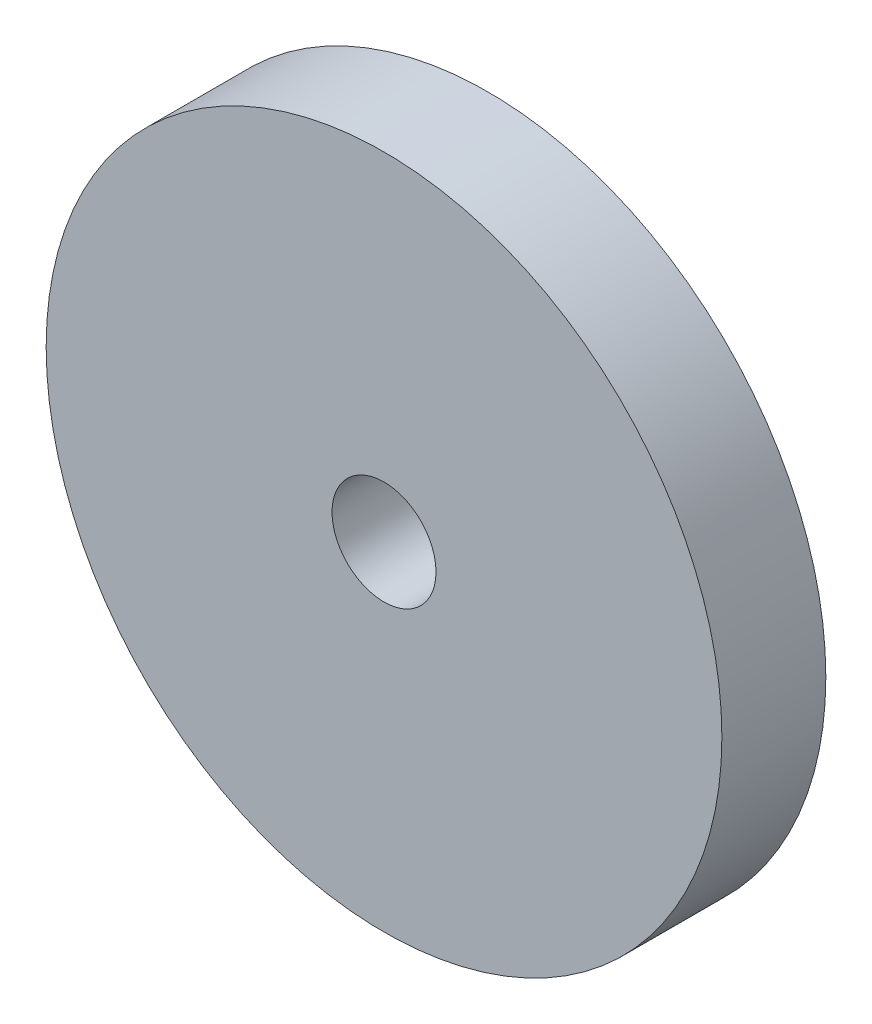
ISO-10303-21;
HEADER;
FILE_DESCRIPTION(('STEP AP214'),'2;1');
FILE_NAME('part.step','',(''),(''),'','','');
FILE_SCHEMA(('AUTOMOTIVE_DESIGN { 1 0 10303 214 1 1 1 1 }'));
ENDSEC;
DATA;
#1=APPLICATION_CONTEXT('core data for automotive mechanical design processes');
#2=APPLICATION_PROTOCOL_DEFINITION('international standard','automotive_design',2000,#1);
#3=PRODUCT_CONTEXT('',#1,'mechanical');
#4=PRODUCT('Part','Part','',(#3));
#5=PRODUCT_RELATED_PRODUCT_CATEGORY('part','',(#4));
#6=PRODUCT_DEFINITION_FORMATION('','',#4);
#7=PRODUCT_DEFINITION_CONTEXT('part definition',#1,'design');
#8=PRODUCT_DEFINITION('design','',#6,#7);
#9=PRODUCT_DEFINITION_SHAPE('','',#8);
#10=(LENGTH_UNIT() NAMED_UNIT(*) SI_UNIT(.MILLI.,.METRE.));
#11=(NAMED_UNIT(*) PLANE_ANGLE_UNIT() SI_UNIT($,.RADIAN.));
#12=(NAMED_UNIT(*) SI_UNIT($,.STERADIAN.) SOLID_ANGLE_UNIT());
#13=UNCERTAINTY_MEASURE_WITH_UNIT(LENGTH_MEASURE(1.E-05),#10,'distance_accuracy_value','');
#14=(GEOMETRIC_REPRESENTATION_CONTEXT(3) GLOBAL_UNCERTAINTY_ASSIGNED_CONTEXT((#13)) GLOBAL_UNIT_ASSIGNED_CONTEXT((#10,
#11,#12)) REPRESENTATION_CONTEXT('',''));
#15=CARTESIAN_POINT('',(0.,0.,0.));
#16=DIRECTION('',(0.,0.,1.));
#17=DIRECTION('',(1.,0.,0.));
#18=AXIS2_PLACEMENT_3D('',#15,#16,#17);
#19=CARTESIAN_POINT('',(0.,0.,6.35));
#20=DIRECTION('',(0.,0.,1.));
#21=DIRECTION('',(1.,0.,0.));
#22=AXIS2_PLACEMENT_3D('',#19,#20,#21);
#23=PLANE('',#22);
#24=CARTESIAN_POINT('',(0.,0.,6.35));
#25=DIRECTION('',(0.,0.,1.));
#26=DIRECTION('',(1.,0.,0.));
#27=AXIS2_PLACEMENT_3D('',#24,#25,#26);
#28=CIRCLE('',#27,41.275);
#29=CARTESIAN_POINT('',(41.275,0.,6.35));
#30=VERTEX_POINT('',#29);
#31=EDGE_CURVE('E10',#30,#30,#28,.T.);
#32=ORIENTED_EDGE('',*,*,#31,.T.);
#33=EDGE_LOOP('',(#32));
#34=FACE_BOUND('',#33,.T.);
#35=CARTESIAN_POINT('',(0.,0.,6.35));
#36=DIRECTION('',(0.,0.,1.));
#37=DIRECTION('',(1.,0.,0.));
#38=AXIS2_PLACEMENT_3D('',#35,#36,#37);
#39=CIRCLE('',#38,6.35);
#40=CARTESIAN_POINT('',(6.35,0.,6.35));
#41=VERTEX_POINT('',#40);
#42=EDGE_CURVE('E42',#41,#41,#39,.T.);
#43=ORIENTED_EDGE('',*,*,#42,.F.);
#44=EDGE_LOOP('',(#43));
#45=FACE_BOUND('',#44,.T.);
#46=ADVANCED_FACE('F31',(#34,#45),#23,.T.);
#47=CARTESIAN_POINT('',(0.,0.,-6.35));
#48=DIRECTION('',(0.,0.,1.));
#49=DIRECTION('',(1.,0.,0.));
#50=AXIS2_PLACEMENT_3D('',#47,#48,#49);
#51=PLANE('',#50);
#52=CARTESIAN_POINT('',(0.,0.,-6.35));
#53=DIRECTION('',(0.,0.,1.));
#54=DIRECTION('',(1.,0.,0.));
#55=AXIS2_PLACEMENT_3D('',#52,#53,#54);
#56=CIRCLE('',#55,41.275);
#57=CARTESIAN_POINT('',(41.275,0.,-6.35));
#58=VERTEX_POINT('',#57);
#59=EDGE_CURVE('E35',#58,#58,#56,.T.);
#60=ORIENTED_EDGE('',*,*,#59,.F.);
#61=EDGE_LOOP('',(#60));
#62=FACE_BOUND('',#61,.T.);
#63=CARTESIAN_POINT('',(0.,0.,-6.35));
#64=DIRECTION('',(0.,0.,1.));
#65=DIRECTION('',(1.,0.,0.));
#66=AXIS2_PLACEMENT_3D('',#63,#64,#65);
#67=CIRCLE('',#66,6.35);
#68=CARTESIAN_POINT('',(6.35,0.,-6.35));
#69=VERTEX_POINT('',#68);
#70=EDGE_CURVE('E44',#69,#69,#67,.T.);
#71=ORIENTED_EDGE('',*,*,#70,.T.);
#72=EDGE_LOOP('',(#71));
#73=FACE_BOUND('',#72,.T.);
#74=ADVANCED_FACE('F54',(#62,#73),#51,.F.);
#75=CARTESIAN_POINT('',(0.,0.,6.35));
#76=DIRECTION('',(0.,0.,-1.));
#77=DIRECTION('',(-1.,0.,0.));
#78=AXIS2_PLACEMENT_3D('',#75,#76,#77);
#79=CYLINDRICAL_SURFACE('',#78,41.275);
#80=ORIENTED_EDGE('',*,*,#31,.F.);
#81=EDGE_LOOP('',(#80));
#82=FACE_BOUND('',#81,.T.);
#83=ORIENTED_EDGE('',*,*,#59,.T.);
#84=EDGE_LOOP('',(#83));
#85=FACE_BOUND('',#84,.T.);
#86=ADVANCED_FACE('F33',(#82,#85),#79,.T.);
#87=CARTESIAN_POINT('',(0.,0.,6.35));
#88=DIRECTION('',(0.,0.,-1.));
#89=DIRECTION('',(-1.,0.,0.));
#90=AXIS2_PLACEMENT_3D('',#87,#88,#89);
#91=CYLINDRICAL_SURFACE('',#90,6.35);
#92=ORIENTED_EDGE('',*,*,#42,.T.);
#93=EDGE_LOOP('',(#92));
#94=FACE_BOUND('',#93,.T.);
#95=ORIENTED_EDGE('',*,*,#70,.F.);
#96=EDGE_LOOP('',(#95));
#97=FACE_BOUND('',#96,.T.);
#98=ADVANCED_FACE('F50',(#94,#97),#91,.F.);
#99=CLOSED_SHELL('',(#46,#74,#86,#98));
#100=MANIFOLD_SOLID_BREP('B2',#99);
#101=ADVANCED_BREP_SHAPE_REPRESENTATION('',(#18,#100),#14);
#102=SHAPE_DEFINITION_REPRESENTATION(#9,#101);
ENDSEC;
END-ISO-10303-21;
